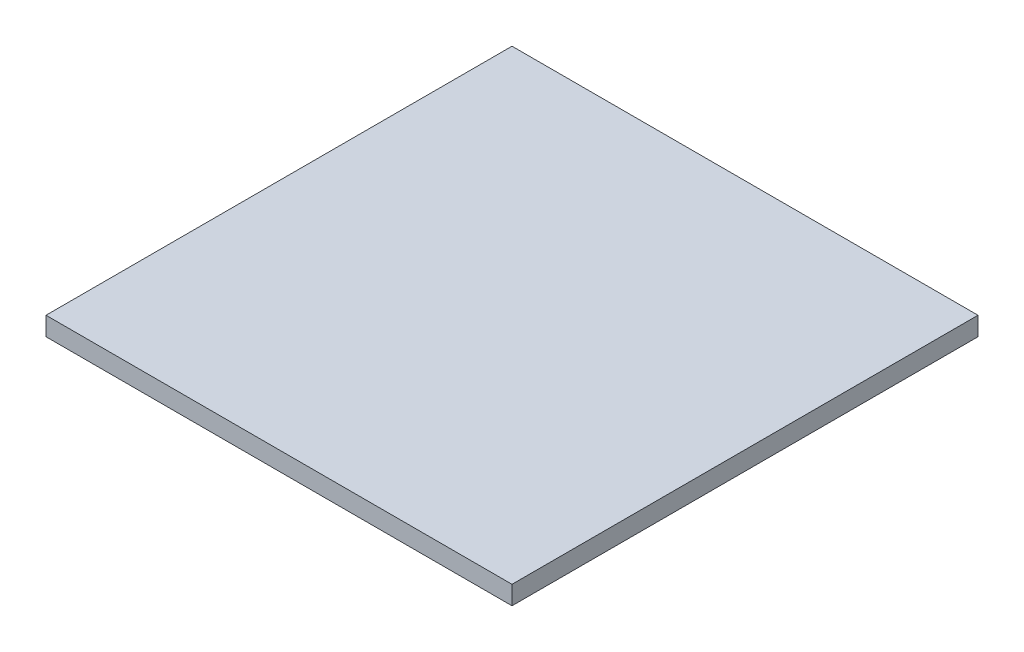
ISO-10303-21;
HEADER;
FILE_DESCRIPTION(('STEP AP214'),'2;1');
FILE_NAME('part.step','',(''),(''),'','','');
FILE_SCHEMA(('AUTOMOTIVE_DESIGN { 1 0 10303 214 1 1 1 1 }'));
ENDSEC;
DATA;
#1=APPLICATION_CONTEXT('core data for automotive mechanical design processes');
#2=APPLICATION_PROTOCOL_DEFINITION('international standard','automotive_design',2000,#1);
#3=PRODUCT_CONTEXT('',#1,'mechanical');
#4=PRODUCT('Part','Part','',(#3));
#5=PRODUCT_RELATED_PRODUCT_CATEGORY('part','',(#4));
#6=PRODUCT_DEFINITION_FORMATION('','',#4);
#7=PRODUCT_DEFINITION_CONTEXT('part definition',#1,'design');
#8=PRODUCT_DEFINITION('design','',#6,#7);
#9=PRODUCT_DEFINITION_SHAPE('','',#8);
#10=(LENGTH_UNIT() NAMED_UNIT(*) SI_UNIT(.MILLI.,.METRE.));
#11=(NAMED_UNIT(*) PLANE_ANGLE_UNIT() SI_UNIT($,.RADIAN.));
#12=(NAMED_UNIT(*) SI_UNIT($,.STERADIAN.) SOLID_ANGLE_UNIT());
#13=UNCERTAINTY_MEASURE_WITH_UNIT(LENGTH_MEASURE(1.E-05),#10,'distance_accuracy_value','');
#14=(GEOMETRIC_REPRESENTATION_CONTEXT(3) GLOBAL_UNCERTAINTY_ASSIGNED_CONTEXT((#13)) GLOBAL_UNIT_ASSIGNED_CONTEXT((#10,
#11,#12)) REPRESENTATION_CONTEXT('',''));
#15=CARTESIAN_POINT('',(0.,0.,0.));
#16=DIRECTION('',(0.,0.,1.));
#17=DIRECTION('',(1.,0.,0.));
#18=AXIS2_PLACEMENT_3D('',#15,#16,#17);
#19=CARTESIAN_POINT('',(150.,12.,-150.));
#20=DIRECTION('',(-1.,0.,0.));
#21=DIRECTION('',(0.,0.,1.));
#22=AXIS2_PLACEMENT_3D('',#19,#20,#21);
#23=PLANE('',#22);
#24=DIRECTION('',(0.,0.,-1.));
#25=VECTOR('',#24,1.);
#26=CARTESIAN_POINT('',(150.,0.,-150.));
#27=LINE('',#26,#25);
#28=CARTESIAN_POINT('',(150.,0.,150.));
#29=VERTEX_POINT('',#28);
#30=CARTESIAN_POINT('',(150.,0.,-150.));
#31=VERTEX_POINT('',#30);
#32=EDGE_CURVE('E96',#29,#31,#27,.T.);
#33=ORIENTED_EDGE('',*,*,#32,.T.);
#34=DIRECTION('',(0.,-1.,0.));
#35=VECTOR('',#34,1.);
#36=CARTESIAN_POINT('',(150.,12.,-150.));
#37=LINE('',#36,#35);
#38=CARTESIAN_POINT('',(150.,12.,-150.));
#39=VERTEX_POINT('',#38);
#40=EDGE_CURVE('E11',#39,#31,#37,.T.);
#41=ORIENTED_EDGE('',*,*,#40,.F.);
#42=DIRECTION('',(0.,0.,-1.));
#43=VECTOR('',#42,1.);
#44=CARTESIAN_POINT('',(150.,12.,-150.));
#45=LINE('',#44,#43);
#46=CARTESIAN_POINT('',(150.,12.,150.));
#47=VERTEX_POINT('',#46);
#48=EDGE_CURVE('E84',#47,#39,#45,.T.);
#49=ORIENTED_EDGE('',*,*,#48,.F.);
#50=DIRECTION('',(0.,-1.,0.));
#51=VECTOR('',#50,1.);
#52=CARTESIAN_POINT('',(150.,12.,150.));
#53=LINE('',#52,#51);
#54=EDGE_CURVE('E92',#47,#29,#53,.T.);
#55=ORIENTED_EDGE('',*,*,#54,.T.);
#56=EDGE_LOOP('',(#33,#41,#49,#55));
#57=FACE_BOUND('',#56,.T.);
#58=ADVANCED_FACE('F33',(#57),#23,.F.);
#59=CARTESIAN_POINT('',(-150.,12.,-150.));
#60=DIRECTION('',(0.,0.,1.));
#61=DIRECTION('',(1.,0.,0.));
#62=AXIS2_PLACEMENT_3D('',#59,#60,#61);
#63=PLANE('',#62);
#64=DIRECTION('',(-1.,0.,0.));
#65=VECTOR('',#64,1.);
#66=CARTESIAN_POINT('',(-150.,0.,-150.));
#67=LINE('',#66,#65);
#68=CARTESIAN_POINT('',(-150.,0.,-150.));
#69=VERTEX_POINT('',#68);
#70=EDGE_CURVE('E88',#31,#69,#67,.T.);
#71=ORIENTED_EDGE('',*,*,#70,.T.);
#72=DIRECTION('',(0.,-1.,0.));
#73=VECTOR('',#72,1.);
#74=CARTESIAN_POINT('',(-150.,12.,-150.));
#75=LINE('',#74,#73);
#76=CARTESIAN_POINT('',(-150.,12.,-150.));
#77=VERTEX_POINT('',#76);
#78=EDGE_CURVE('E41',#77,#69,#75,.T.);
#79=ORIENTED_EDGE('',*,*,#78,.F.);
#80=DIRECTION('',(-1.,0.,0.));
#81=VECTOR('',#80,1.);
#82=CARTESIAN_POINT('',(-150.,12.,-150.));
#83=LINE('',#82,#81);
#84=EDGE_CURVE('E79',#39,#77,#83,.T.);
#85=ORIENTED_EDGE('',*,*,#84,.F.);
#86=ORIENTED_EDGE('',*,*,#40,.T.);
#87=EDGE_LOOP('',(#71,#79,#85,#86));
#88=FACE_BOUND('',#87,.T.);
#89=ADVANCED_FACE('F87',(#88),#63,.F.);
#90=CARTESIAN_POINT('',(-150.,12.,-150.));
#91=DIRECTION('',(1.,0.,0.));
#92=DIRECTION('',(0.,0.,-1.));
#93=AXIS2_PLACEMENT_3D('',#90,#91,#92);
#94=PLANE('',#93);
#95=DIRECTION('',(0.,0.,1.));
#96=VECTOR('',#95,1.);
#97=CARTESIAN_POINT('',(-150.,0.,-150.));
#98=LINE('',#97,#96);
#99=CARTESIAN_POINT('',(-150.,0.,150.));
#100=VERTEX_POINT('',#99);
#101=EDGE_CURVE('E66',#69,#100,#98,.T.);
#102=ORIENTED_EDGE('',*,*,#101,.T.);
#103=DIRECTION('',(0.,-1.,0.));
#104=VECTOR('',#103,1.);
#105=CARTESIAN_POINT('',(-150.,12.,150.));
#106=LINE('',#105,#104);
#107=CARTESIAN_POINT('',(-150.,12.,150.));
#108=VERTEX_POINT('',#107);
#109=EDGE_CURVE('E89',#108,#100,#106,.T.);
#110=ORIENTED_EDGE('',*,*,#109,.F.);
#111=DIRECTION('',(0.,0.,1.));
#112=VECTOR('',#111,1.);
#113=CARTESIAN_POINT('',(-150.,12.,-150.));
#114=LINE('',#113,#112);
#115=EDGE_CURVE('E82',#77,#108,#114,.T.);
#116=ORIENTED_EDGE('',*,*,#115,.F.);
#117=ORIENTED_EDGE('',*,*,#78,.T.);
#118=EDGE_LOOP('',(#102,#110,#116,#117));
#119=FACE_BOUND('',#118,.T.);
#120=ADVANCED_FACE('F90',(#119),#94,.F.);
#121=CARTESIAN_POINT('',(-150.,12.,150.));
#122=DIRECTION('',(0.,0.,-1.));
#123=DIRECTION('',(-1.,0.,0.));
#124=AXIS2_PLACEMENT_3D('',#121,#122,#123);
#125=PLANE('',#124);
#126=DIRECTION('',(1.,0.,0.));
#127=VECTOR('',#126,1.);
#128=CARTESIAN_POINT('',(-150.,0.,150.));
#129=LINE('',#128,#127);
#130=EDGE_CURVE('E72',#100,#29,#129,.T.);
#131=ORIENTED_EDGE('',*,*,#130,.T.);
#132=ORIENTED_EDGE('',*,*,#54,.F.);
#133=DIRECTION('',(1.,0.,0.));
#134=VECTOR('',#133,1.);
#135=CARTESIAN_POINT('',(-150.,12.,150.));
#136=LINE('',#135,#134);
#137=EDGE_CURVE('E49',#108,#47,#136,.T.);
#138=ORIENTED_EDGE('',*,*,#137,.F.);
#139=ORIENTED_EDGE('',*,*,#109,.T.);
#140=EDGE_LOOP('',(#131,#132,#138,#139));
#141=FACE_BOUND('',#140,.T.);
#142=ADVANCED_FACE('F103',(#141),#125,.F.);
#143=CARTESIAN_POINT('',(0.,12.,0.));
#144=DIRECTION('',(0.,1.,0.));
#145=DIRECTION('',(0.,0.,1.));
#146=AXIS2_PLACEMENT_3D('',#143,#144,#145);
#147=PLANE('',#146);
#148=ORIENTED_EDGE('',*,*,#48,.T.);
#149=ORIENTED_EDGE('',*,*,#84,.T.);
#150=ORIENTED_EDGE('',*,*,#115,.T.);
#151=ORIENTED_EDGE('',*,*,#137,.T.);
#152=EDGE_LOOP('',(#148,#149,#150,#151));
#153=FACE_BOUND('',#152,.T.);
#154=ADVANCED_FACE('F80',(#153),#147,.T.);
#155=CARTESIAN_POINT('',(0.,0.,0.));
#156=DIRECTION('',(0.,1.,0.));
#157=DIRECTION('',(0.,0.,1.));
#158=AXIS2_PLACEMENT_3D('',#155,#156,#157);
#159=PLANE('',#158);
#160=ORIENTED_EDGE('',*,*,#32,.F.);
#161=ORIENTED_EDGE('',*,*,#130,.F.);
#162=ORIENTED_EDGE('',*,*,#101,.F.);
#163=ORIENTED_EDGE('',*,*,#70,.F.);
#164=EDGE_LOOP('',(#160,#161,#162,#163));
#165=FACE_BOUND('',#164,.T.);
#166=ADVANCED_FACE('F106',(#165),#159,.F.);
#167=CLOSED_SHELL('',(#58,#89,#120,#142,#154,#166));
#168=MANIFOLD_SOLID_BREP('B2',#167);
#169=ADVANCED_BREP_SHAPE_REPRESENTATION('',(#18,#168),#14);
#170=SHAPE_DEFINITION_REPRESENTATION(#9,#169);
ENDSEC;
END-ISO-10303-21;
